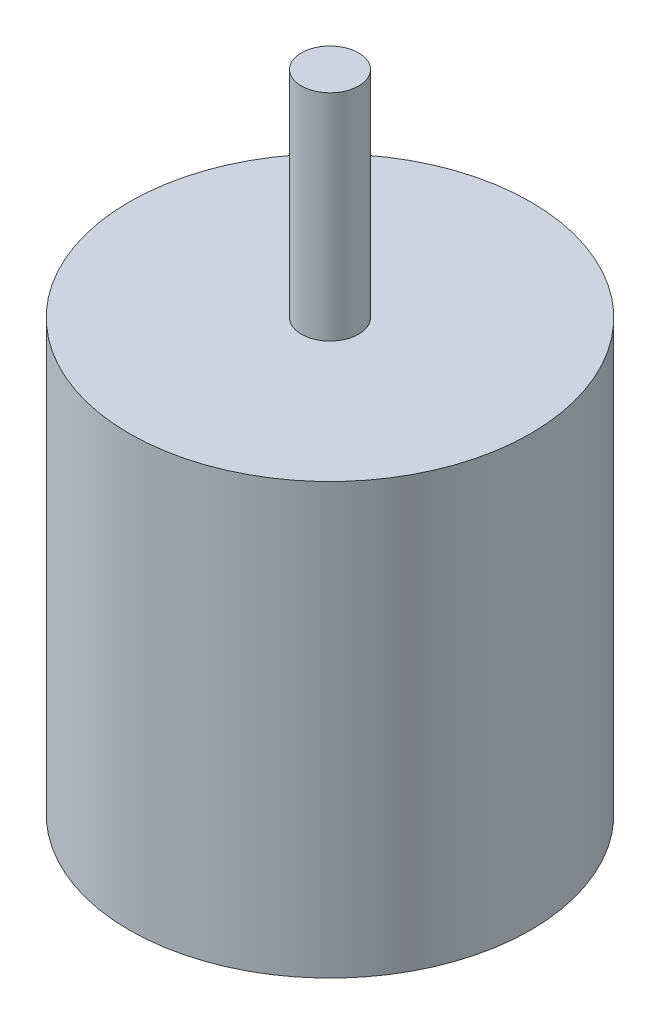
ISO-10303-21;
HEADER;
FILE_DESCRIPTION(('STEP AP214'),'2;1');
FILE_NAME('part.step','',(''),(''),'','','');
FILE_SCHEMA(('AUTOMOTIVE_DESIGN { 1 0 10303 214 1 1 1 1 }'));
ENDSEC;
DATA;
#1=APPLICATION_CONTEXT('core data for automotive mechanical design processes');
#2=APPLICATION_PROTOCOL_DEFINITION('international standard','automotive_design',2000,#1);
#3=PRODUCT_CONTEXT('',#1,'mechanical');
#4=PRODUCT('Part','Part','',(#3));
#5=PRODUCT_RELATED_PRODUCT_CATEGORY('part','',(#4));
#6=PRODUCT_DEFINITION_FORMATION('','',#4);
#7=PRODUCT_DEFINITION_CONTEXT('part definition',#1,'design');
#8=PRODUCT_DEFINITION('design','',#6,#7);
#9=PRODUCT_DEFINITION_SHAPE('','',#8);
#10=(LENGTH_UNIT() NAMED_UNIT(*) SI_UNIT(.MILLI.,.METRE.));
#11=(NAMED_UNIT(*) PLANE_ANGLE_UNIT() SI_UNIT($,.RADIAN.));
#12=(NAMED_UNIT(*) SI_UNIT($,.STERADIAN.) SOLID_ANGLE_UNIT());
#13=UNCERTAINTY_MEASURE_WITH_UNIT(LENGTH_MEASURE(1.E-05),#10,'distance_accuracy_value','');
#14=(GEOMETRIC_REPRESENTATION_CONTEXT(3) GLOBAL_UNCERTAINTY_ASSIGNED_CONTEXT((#13)) GLOBAL_UNIT_ASSIGNED_CONTEXT((#10,
#11,#12)) REPRESENTATION_CONTEXT('',''));
#15=CARTESIAN_POINT('',(0.,0.,0.));
#16=DIRECTION('',(0.,0.,1.));
#17=DIRECTION('',(1.,0.,0.));
#18=AXIS2_PLACEMENT_3D('',#15,#16,#17);
#19=CARTESIAN_POINT('',(0.,30.,0.));
#20=DIRECTION('',(0.,-1.,0.));
#21=DIRECTION('',(0.,0.,-1.));
#22=AXIS2_PLACEMENT_3D('',#19,#20,#21);
#23=CYLINDRICAL_SURFACE('',#22,14.);
#24=CARTESIAN_POINT('',(0.,30.,0.));
#25=DIRECTION('',(0.,1.,0.));
#26=DIRECTION('',(0.,0.,1.));
#27=AXIS2_PLACEMENT_3D('',#24,#25,#26);
#28=CIRCLE('',#27,14.);
#29=CARTESIAN_POINT('',(0.,30.,14.));
#30=VERTEX_POINT('',#29);
#31=EDGE_CURVE('E10',#30,#30,#28,.T.);
#32=ORIENTED_EDGE('',*,*,#31,.F.);
#33=EDGE_LOOP('',(#32));
#34=FACE_BOUND('',#33,.T.);
#35=CARTESIAN_POINT('',(0.,0.,0.));
#36=DIRECTION('',(0.,1.,0.));
#37=DIRECTION('',(0.,0.,1.));
#38=AXIS2_PLACEMENT_3D('',#35,#36,#37);
#39=CIRCLE('',#38,14.);
#40=CARTESIAN_POINT('',(0.,0.,14.));
#41=VERTEX_POINT('',#40);
#42=EDGE_CURVE('E38',#41,#41,#39,.T.);
#43=ORIENTED_EDGE('',*,*,#42,.T.);
#44=EDGE_LOOP('',(#43));
#45=FACE_BOUND('',#44,.T.);
#46=ADVANCED_FACE('F35',(#34,#45),#23,.T.);
#47=CARTESIAN_POINT('',(0.,30.,0.));
#48=DIRECTION('',(0.,1.,0.));
#49=DIRECTION('',(0.,0.,1.));
#50=AXIS2_PLACEMENT_3D('',#47,#48,#49);
#51=PLANE('',#50);
#52=CARTESIAN_POINT('',(0.,30.,0.));
#53=DIRECTION('',(0.,1.,0.));
#54=DIRECTION('',(0.,0.,1.));
#55=AXIS2_PLACEMENT_3D('',#52,#53,#54);
#56=CIRCLE('',#55,2.);
#57=CARTESIAN_POINT('',(0.,30.,2.));
#58=VERTEX_POINT('',#57);
#59=EDGE_CURVE('E47',#58,#58,#56,.T.);
#60=ORIENTED_EDGE('',*,*,#59,.F.);
#61=EDGE_LOOP('',(#60));
#62=FACE_BOUND('',#61,.T.);
#63=ORIENTED_EDGE('',*,*,#31,.T.);
#64=EDGE_LOOP('',(#63));
#65=FACE_BOUND('',#64,.T.);
#66=ADVANCED_FACE('F62',(#62,#65),#51,.T.);
#67=CARTESIAN_POINT('',(0.,0.,0.));
#68=DIRECTION('',(0.,1.,0.));
#69=DIRECTION('',(0.,0.,1.));
#70=AXIS2_PLACEMENT_3D('',#67,#68,#69);
#71=PLANE('',#70);
#72=ORIENTED_EDGE('',*,*,#42,.F.);
#73=EDGE_LOOP('',(#72));
#74=FACE_BOUND('',#73,.T.);
#75=ADVANCED_FACE('F58',(#74),#71,.F.);
#76=CARTESIAN_POINT('',(0.,45.,0.));
#77=DIRECTION('',(0.,-1.,0.));
#78=DIRECTION('',(0.,0.,-1.));
#79=AXIS2_PLACEMENT_3D('',#76,#77,#78);
#80=CYLINDRICAL_SURFACE('',#79,2.);
#81=CARTESIAN_POINT('',(0.,45.,0.));
#82=DIRECTION('',(0.,1.,0.));
#83=DIRECTION('',(0.,0.,1.));
#84=AXIS2_PLACEMENT_3D('',#81,#82,#83);
#85=CIRCLE('',#84,2.);
#86=CARTESIAN_POINT('',(0.,45.,2.));
#87=VERTEX_POINT('',#86);
#88=EDGE_CURVE('E45',#87,#87,#85,.T.);
#89=ORIENTED_EDGE('',*,*,#88,.F.);
#90=EDGE_LOOP('',(#89));
#91=FACE_BOUND('',#90,.T.);
#92=ORIENTED_EDGE('',*,*,#59,.T.);
#93=EDGE_LOOP('',(#92));
#94=FACE_BOUND('',#93,.T.);
#95=ADVANCED_FACE('F55',(#91,#94),#80,.T.);
#96=CARTESIAN_POINT('',(0.,45.,0.));
#97=DIRECTION('',(0.,1.,0.));
#98=DIRECTION('',(0.,0.,1.));
#99=AXIS2_PLACEMENT_3D('',#96,#97,#98);
#100=PLANE('',#99);
#101=ORIENTED_EDGE('',*,*,#88,.T.);
#102=EDGE_LOOP('',(#101));
#103=FACE_BOUND('',#102,.T.);
#104=ADVANCED_FACE('F53',(#103),#100,.T.);
#105=CLOSED_SHELL('',(#46,#66,#75,#95,#104));
#106=MANIFOLD_SOLID_BREP('B2',#105);
#107=ADVANCED_BREP_SHAPE_REPRESENTATION('',(#18,#106),#14);
#108=SHAPE_DEFINITION_REPRESENTATION(#9,#107);
ENDSEC;
END-ISO-10303-21;
